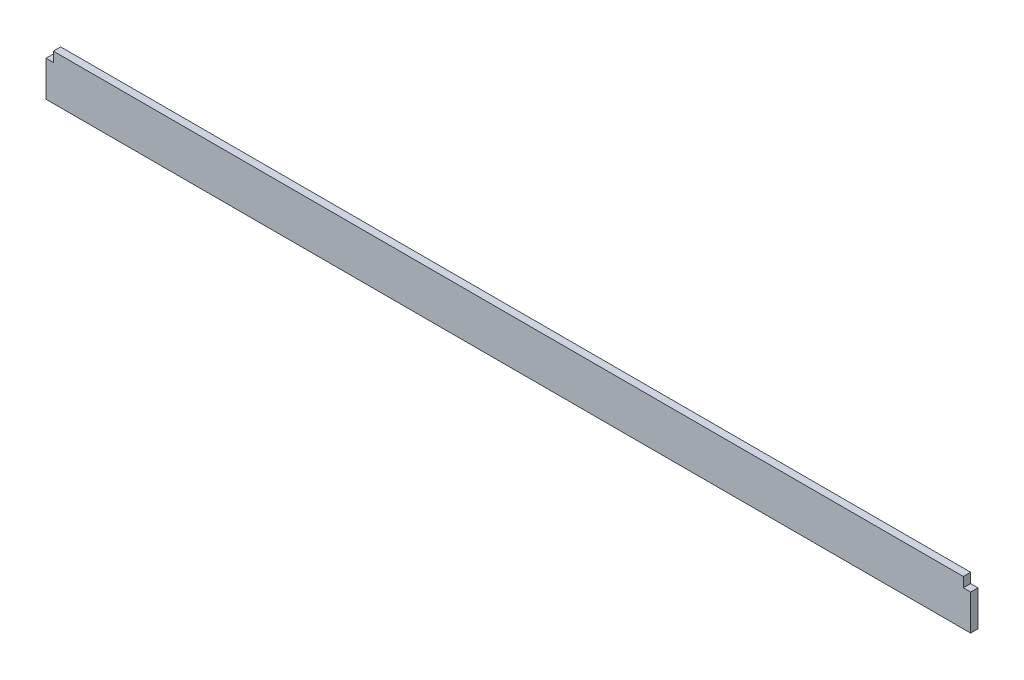
ISO-10303-21;
HEADER;
FILE_DESCRIPTION(('STEP AP214'),'2;1');
FILE_NAME('part.step','',(''),(''),'','','');
FILE_SCHEMA(('AUTOMOTIVE_DESIGN { 1 0 10303 214 1 1 1 1 }'));
ENDSEC;
DATA;
#1=APPLICATION_CONTEXT('core data for automotive mechanical design processes');
#2=APPLICATION_PROTOCOL_DEFINITION('international standard','automotive_design',2000,#1);
#3=PRODUCT_CONTEXT('',#1,'mechanical');
#4=PRODUCT('Part','Part','',(#3));
#5=PRODUCT_RELATED_PRODUCT_CATEGORY('part','',(#4));
#6=PRODUCT_DEFINITION_FORMATION('','',#4);
#7=PRODUCT_DEFINITION_CONTEXT('part definition',#1,'design');
#8=PRODUCT_DEFINITION('design','',#6,#7);
#9=PRODUCT_DEFINITION_SHAPE('','',#8);
#10=(LENGTH_UNIT() NAMED_UNIT(*) SI_UNIT(.MILLI.,.METRE.));
#11=(NAMED_UNIT(*) PLANE_ANGLE_UNIT() SI_UNIT($,.RADIAN.));
#12=(NAMED_UNIT(*) SI_UNIT($,.STERADIAN.) SOLID_ANGLE_UNIT());
#13=UNCERTAINTY_MEASURE_WITH_UNIT(LENGTH_MEASURE(1.E-05),#10,'distance_accuracy_value','');
#14=(GEOMETRIC_REPRESENTATION_CONTEXT(3) GLOBAL_UNCERTAINTY_ASSIGNED_CONTEXT((#13)) GLOBAL_UNIT_ASSIGNED_CONTEXT((#10,
#11,#12)) REPRESENTATION_CONTEXT('',''));
#15=CARTESIAN_POINT('',(0.,0.,0.));
#16=DIRECTION('',(0.,0.,1.));
#17=DIRECTION('',(1.,0.,0.));
#18=AXIS2_PLACEMENT_3D('',#15,#16,#17);
#19=CARTESIAN_POINT('',(0.,0.,38.1));
#20=DIRECTION('',(1.,0.,0.));
#21=DIRECTION('',(0.,1.,0.));
#22=AXIS2_PLACEMENT_3D('',#19,#20,#21);
#23=PLANE('',#22);
#24=DIRECTION('',(0.,-1.,0.));
#25=VECTOR('',#24,1.);
#26=CARTESIAN_POINT('',(0.,0.,0.));
#27=LINE('',#26,#25);
#28=CARTESIAN_POINT('',(0.,184.15,0.));
#29=VERTEX_POINT('',#28);
#30=CARTESIAN_POINT('',(0.,0.,0.));
#31=VERTEX_POINT('',#30);
#32=EDGE_CURVE('E129',#29,#31,#27,.T.);
#33=ORIENTED_EDGE('',*,*,#32,.T.);
#34=DIRECTION('',(0.,0.,-1.));
#35=VECTOR('',#34,1.);
#36=CARTESIAN_POINT('',(0.,0.,38.1));
#37=LINE('',#36,#35);
#38=CARTESIAN_POINT('',(0.,0.,38.1));
#39=VERTEX_POINT('',#38);
#40=EDGE_CURVE('E11',#39,#31,#37,.T.);
#41=ORIENTED_EDGE('',*,*,#40,.F.);
#42=DIRECTION('',(0.,-1.,0.));
#43=VECTOR('',#42,1.);
#44=CARTESIAN_POINT('',(0.,0.,38.1));
#45=LINE('',#44,#43);
#46=CARTESIAN_POINT('',(0.,184.15,38.1));
#47=VERTEX_POINT('',#46);
#48=EDGE_CURVE('E143',#47,#39,#45,.T.);
#49=ORIENTED_EDGE('',*,*,#48,.F.);
#50=DIRECTION('',(0.,0.,-1.));
#51=VECTOR('',#50,1.);
#52=CARTESIAN_POINT('',(0.,184.15,38.1));
#53=LINE('',#52,#51);
#54=EDGE_CURVE('E125',#47,#29,#53,.T.);
#55=ORIENTED_EDGE('',*,*,#54,.T.);
#56=EDGE_LOOP('',(#33,#41,#49,#55));
#57=FACE_BOUND('',#56,.T.);
#58=ADVANCED_FACE('F33',(#57),#23,.F.);
#59=CARTESIAN_POINT('',(0.,0.,38.1));
#60=DIRECTION('',(0.,1.,0.));
#61=DIRECTION('',(0.,0.,1.));
#62=AXIS2_PLACEMENT_3D('',#59,#60,#61);
#63=PLANE('',#62);
#64=DIRECTION('',(1.,0.,0.));
#65=VECTOR('',#64,1.);
#66=CARTESIAN_POINT('',(0.,0.,0.));
#67=LINE('',#66,#65);
#68=CARTESIAN_POINT('',(4787.9,0.,0.));
#69=VERTEX_POINT('',#68);
#70=EDGE_CURVE('E132',#31,#69,#67,.T.);
#71=ORIENTED_EDGE('',*,*,#70,.T.);
#72=DIRECTION('',(0.,0.,-1.));
#73=VECTOR('',#72,1.);
#74=CARTESIAN_POINT('',(4787.9,0.,38.1));
#75=LINE('',#74,#73);
#76=CARTESIAN_POINT('',(4787.9,0.,38.1));
#77=VERTEX_POINT('',#76);
#78=EDGE_CURVE('E41',#77,#69,#75,.T.);
#79=ORIENTED_EDGE('',*,*,#78,.F.);
#80=DIRECTION('',(1.,0.,0.));
#81=VECTOR('',#80,1.);
#82=CARTESIAN_POINT('',(0.,0.,38.1));
#83=LINE('',#82,#81);
#84=EDGE_CURVE('E92',#39,#77,#83,.T.);
#85=ORIENTED_EDGE('',*,*,#84,.F.);
#86=ORIENTED_EDGE('',*,*,#40,.T.);
#87=EDGE_LOOP('',(#71,#79,#85,#86));
#88=FACE_BOUND('',#87,.T.);
#89=ADVANCED_FACE('F178',(#88),#63,.F.);
#90=CARTESIAN_POINT('',(4787.9,0.,38.1));
#91=DIRECTION('',(-1.,0.,0.));
#92=DIRECTION('',(0.,0.,1.));
#93=AXIS2_PLACEMENT_3D('',#90,#91,#92);
#94=PLANE('',#93);
#95=DIRECTION('',(0.,1.,0.));
#96=VECTOR('',#95,1.);
#97=CARTESIAN_POINT('',(4787.9,0.,0.));
#98=LINE('',#97,#96);
#99=CARTESIAN_POINT('',(4787.9,184.15,0.));
#100=VERTEX_POINT('',#99);
#101=EDGE_CURVE('E134',#69,#100,#98,.T.);
#102=ORIENTED_EDGE('',*,*,#101,.T.);
#103=DIRECTION('',(0.,0.,-1.));
#104=VECTOR('',#103,1.);
#105=CARTESIAN_POINT('',(4787.9,184.15,38.1));
#106=LINE('',#105,#104);
#107=CARTESIAN_POINT('',(4787.9,184.15,38.1));
#108=VERTEX_POINT('',#107);
#109=EDGE_CURVE('E150',#108,#100,#106,.T.);
#110=ORIENTED_EDGE('',*,*,#109,.F.);
#111=DIRECTION('',(0.,1.,0.));
#112=VECTOR('',#111,1.);
#113=CARTESIAN_POINT('',(4787.9,0.,38.1));
#114=LINE('',#113,#112);
#115=EDGE_CURVE('E158',#77,#108,#114,.T.);
#116=ORIENTED_EDGE('',*,*,#115,.F.);
#117=ORIENTED_EDGE('',*,*,#78,.T.);
#118=EDGE_LOOP('',(#102,#110,#116,#117));
#119=FACE_BOUND('',#118,.T.);
#120=ADVANCED_FACE('F156',(#119),#94,.F.);
#121=CARTESIAN_POINT('',(4787.9,184.15,38.1));
#122=DIRECTION('',(0.,-1.,0.));
#123=DIRECTION('',(0.,0.,-1.));
#124=AXIS2_PLACEMENT_3D('',#121,#122,#123);
#125=PLANE('',#124);
#126=DIRECTION('',(-1.,0.,0.));
#127=VECTOR('',#126,1.);
#128=CARTESIAN_POINT('',(4787.9,184.15,0.));
#129=LINE('',#128,#127);
#130=CARTESIAN_POINT('',(4749.8,184.15,0.));
#131=VERTEX_POINT('',#130);
#132=EDGE_CURVE('E136',#100,#131,#129,.T.);
#133=ORIENTED_EDGE('',*,*,#132,.T.);
#134=DIRECTION('',(0.,0.,-1.));
#135=VECTOR('',#134,1.);
#136=CARTESIAN_POINT('',(4749.8,184.15,38.1));
#137=LINE('',#136,#135);
#138=CARTESIAN_POINT('',(4749.8,184.15,38.1));
#139=VERTEX_POINT('',#138);
#140=EDGE_CURVE('E147',#139,#131,#137,.T.);
#141=ORIENTED_EDGE('',*,*,#140,.F.);
#142=DIRECTION('',(-1.,0.,0.));
#143=VECTOR('',#142,1.);
#144=CARTESIAN_POINT('',(4787.9,184.15,38.1));
#145=LINE('',#144,#143);
#146=EDGE_CURVE('E170',#108,#139,#145,.T.);
#147=ORIENTED_EDGE('',*,*,#146,.F.);
#148=ORIENTED_EDGE('',*,*,#109,.T.);
#149=EDGE_LOOP('',(#133,#141,#147,#148));
#150=FACE_BOUND('',#149,.T.);
#151=ADVANCED_FACE('F166',(#150),#125,.F.);
#152=CARTESIAN_POINT('',(4749.8,234.95,38.1));
#153=DIRECTION('',(-1.,0.,0.));
#154=DIRECTION('',(0.,0.,1.));
#155=AXIS2_PLACEMENT_3D('',#152,#153,#154);
#156=PLANE('',#155);
#157=DIRECTION('',(0.,1.,0.));
#158=VECTOR('',#157,1.);
#159=CARTESIAN_POINT('',(4749.8,234.95,0.));
#160=LINE('',#159,#158);
#161=CARTESIAN_POINT('',(4749.8,234.95,0.));
#162=VERTEX_POINT('',#161);
#163=EDGE_CURVE('E138',#131,#162,#160,.T.);
#164=ORIENTED_EDGE('',*,*,#163,.T.);
#165=DIRECTION('',(0.,0.,-1.));
#166=VECTOR('',#165,1.);
#167=CARTESIAN_POINT('',(4749.8,234.95,38.1));
#168=LINE('',#167,#166);
#169=CARTESIAN_POINT('',(4749.8,234.95,38.1));
#170=VERTEX_POINT('',#169);
#171=EDGE_CURVE('E120',#170,#162,#168,.T.);
#172=ORIENTED_EDGE('',*,*,#171,.F.);
#173=DIRECTION('',(0.,1.,0.));
#174=VECTOR('',#173,1.);
#175=CARTESIAN_POINT('',(4749.8,234.95,38.1));
#176=LINE('',#175,#174);
#177=EDGE_CURVE('E111',#139,#170,#176,.T.);
#178=ORIENTED_EDGE('',*,*,#177,.F.);
#179=ORIENTED_EDGE('',*,*,#140,.T.);
#180=EDGE_LOOP('',(#164,#172,#178,#179));
#181=FACE_BOUND('',#180,.T.);
#182=ADVANCED_FACE('F169',(#181),#156,.F.);
#183=CARTESIAN_POINT('',(38.1,234.95,38.1));
#184=DIRECTION('',(0.,-1.,0.));
#185=DIRECTION('',(0.,0.,-1.));
#186=AXIS2_PLACEMENT_3D('',#183,#184,#185);
#187=PLANE('',#186);
#188=DIRECTION('',(-1.,0.,0.));
#189=VECTOR('',#188,1.);
#190=CARTESIAN_POINT('',(38.1,234.95,0.));
#191=LINE('',#190,#189);
#192=CARTESIAN_POINT('',(38.1,234.95,0.));
#193=VERTEX_POINT('',#192);
#194=EDGE_CURVE('E119',#162,#193,#191,.T.);
#195=ORIENTED_EDGE('',*,*,#194,.T.);
#196=DIRECTION('',(0.,0.,-1.));
#197=VECTOR('',#196,1.);
#198=CARTESIAN_POINT('',(38.1,234.95,38.1));
#199=LINE('',#198,#197);
#200=CARTESIAN_POINT('',(38.1,234.95,38.1));
#201=VERTEX_POINT('',#200);
#202=EDGE_CURVE('E116',#201,#193,#199,.T.);
#203=ORIENTED_EDGE('',*,*,#202,.F.);
#204=DIRECTION('',(-1.,0.,0.));
#205=VECTOR('',#204,1.);
#206=CARTESIAN_POINT('',(38.1,234.95,38.1));
#207=LINE('',#206,#205);
#208=EDGE_CURVE('E105',#170,#201,#207,.T.);
#209=ORIENTED_EDGE('',*,*,#208,.F.);
#210=ORIENTED_EDGE('',*,*,#171,.T.);
#211=EDGE_LOOP('',(#195,#203,#209,#210));
#212=FACE_BOUND('',#211,.T.);
#213=ADVANCED_FACE('F117',(#212),#187,.F.);
#214=CARTESIAN_POINT('',(38.1,234.95,38.1));
#215=DIRECTION('',(1.,0.,0.));
#216=DIRECTION('',(0.,0.,-1.));
#217=AXIS2_PLACEMENT_3D('',#214,#215,#216);
#218=PLANE('',#217);
#219=DIRECTION('',(0.,-1.,0.));
#220=VECTOR('',#219,1.);
#221=CARTESIAN_POINT('',(38.1,234.95,0.));
#222=LINE('',#221,#220);
#223=CARTESIAN_POINT('',(38.1,184.15,0.));
#224=VERTEX_POINT('',#223);
#225=EDGE_CURVE('E78',#193,#224,#222,.T.);
#226=ORIENTED_EDGE('',*,*,#225,.T.);
#227=DIRECTION('',(0.,0.,-1.));
#228=VECTOR('',#227,1.);
#229=CARTESIAN_POINT('',(38.1,184.15,38.1));
#230=LINE('',#229,#228);
#231=CARTESIAN_POINT('',(38.1,184.15,38.1));
#232=VERTEX_POINT('',#231);
#233=EDGE_CURVE('E121',#232,#224,#230,.T.);
#234=ORIENTED_EDGE('',*,*,#233,.F.);
#235=DIRECTION('',(0.,-1.,0.));
#236=VECTOR('',#235,1.);
#237=CARTESIAN_POINT('',(38.1,234.95,38.1));
#238=LINE('',#237,#236);
#239=EDGE_CURVE('E109',#201,#232,#238,.T.);
#240=ORIENTED_EDGE('',*,*,#239,.F.);
#241=ORIENTED_EDGE('',*,*,#202,.T.);
#242=EDGE_LOOP('',(#226,#234,#240,#241));
#243=FACE_BOUND('',#242,.T.);
#244=ADVANCED_FACE('F123',(#243),#218,.F.);
#245=CARTESIAN_POINT('',(0.,184.15,38.1));
#246=DIRECTION('',(0.,-1.,0.));
#247=DIRECTION('',(0.,0.,-1.));
#248=AXIS2_PLACEMENT_3D('',#245,#246,#247);
#249=PLANE('',#248);
#250=DIRECTION('',(-1.,0.,0.));
#251=VECTOR('',#250,1.);
#252=CARTESIAN_POINT('',(0.,184.15,0.));
#253=LINE('',#252,#251);
#254=EDGE_CURVE('E84',#224,#29,#253,.T.);
#255=ORIENTED_EDGE('',*,*,#254,.T.);
#256=ORIENTED_EDGE('',*,*,#54,.F.);
#257=DIRECTION('',(-1.,0.,0.));
#258=VECTOR('',#257,1.);
#259=CARTESIAN_POINT('',(0.,184.15,38.1));
#260=LINE('',#259,#258);
#261=EDGE_CURVE('E49',#232,#47,#260,.T.);
#262=ORIENTED_EDGE('',*,*,#261,.F.);
#263=ORIENTED_EDGE('',*,*,#233,.T.);
#264=EDGE_LOOP('',(#255,#256,#262,#263));
#265=FACE_BOUND('',#264,.T.);
#266=ADVANCED_FACE('F194',(#265),#249,.F.);
#267=CARTESIAN_POINT('',(0.,0.,38.1));
#268=DIRECTION('',(0.,0.,-1.));
#269=DIRECTION('',(-1.,0.,0.));
#270=AXIS2_PLACEMENT_3D('',#267,#268,#269);
#271=PLANE('',#270);
#272=ORIENTED_EDGE('',*,*,#48,.T.);
#273=ORIENTED_EDGE('',*,*,#84,.T.);
#274=ORIENTED_EDGE('',*,*,#115,.T.);
#275=ORIENTED_EDGE('',*,*,#146,.T.);
#276=ORIENTED_EDGE('',*,*,#177,.T.);
#277=ORIENTED_EDGE('',*,*,#208,.T.);
#278=ORIENTED_EDGE('',*,*,#239,.T.);
#279=ORIENTED_EDGE('',*,*,#261,.T.);
#280=EDGE_LOOP('',(#272,#273,#274,#275,#276,#277,#278,#279));
#281=FACE_BOUND('',#280,.T.);
#282=ADVANCED_FACE('F107',(#281),#271,.F.);
#283=CARTESIAN_POINT('',(0.,0.,0.));
#284=DIRECTION('',(0.,0.,-1.));
#285=DIRECTION('',(-1.,0.,0.));
#286=AXIS2_PLACEMENT_3D('',#283,#284,#285);
#287=PLANE('',#286);
#288=ORIENTED_EDGE('',*,*,#32,.F.);
#289=ORIENTED_EDGE('',*,*,#254,.F.);
#290=ORIENTED_EDGE('',*,*,#225,.F.);
#291=ORIENTED_EDGE('',*,*,#194,.F.);
#292=ORIENTED_EDGE('',*,*,#163,.F.);
#293=ORIENTED_EDGE('',*,*,#132,.F.);
#294=ORIENTED_EDGE('',*,*,#101,.F.);
#295=ORIENTED_EDGE('',*,*,#70,.F.);
#296=EDGE_LOOP('',(#288,#289,#290,#291,#292,#293,#294,#295));
#297=FACE_BOUND('',#296,.T.);
#298=ADVANCED_FACE('F162',(#297),#287,.T.);
#299=CLOSED_SHELL('',(#58,#89,#120,#151,#182,#213,#244,#266,#282,#298));
#300=MANIFOLD_SOLID_BREP('B2',#299);
#301=ADVANCED_BREP_SHAPE_REPRESENTATION('',(#18,#300),#14);
#302=SHAPE_DEFINITION_REPRESENTATION(#9,#301);
ENDSEC;
END-ISO-10303-21;
